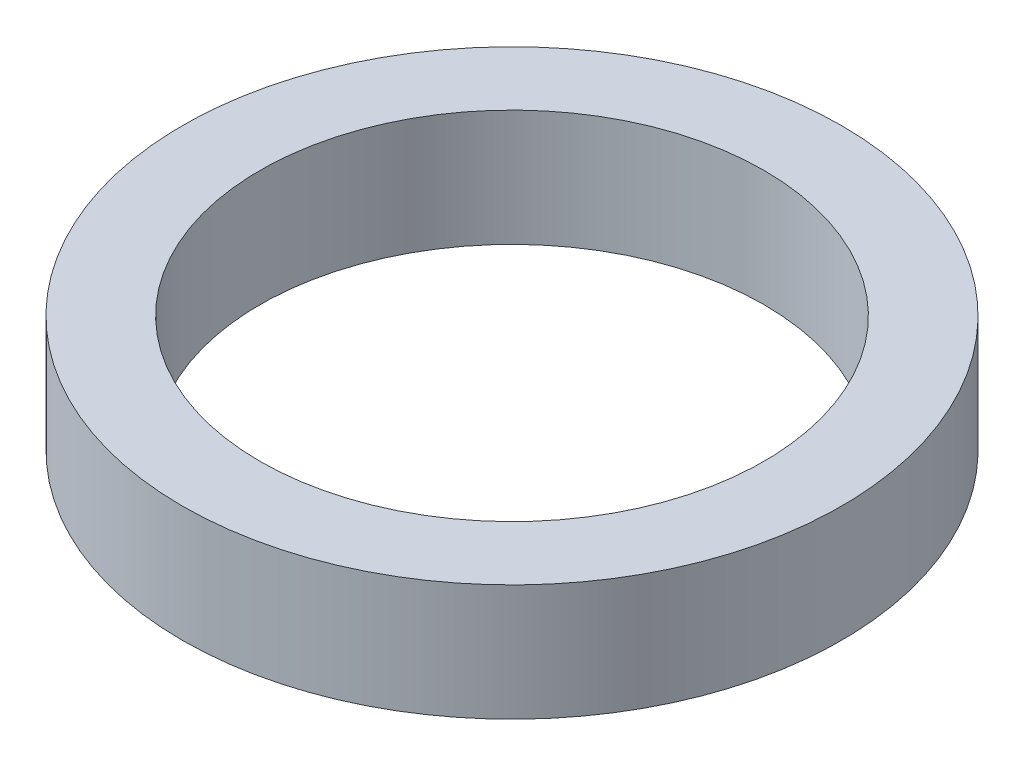
ISO-10303-21;
HEADER;
FILE_DESCRIPTION(('STEP AP214'),'2;1');
FILE_NAME('part.step','',(''),(''),'','','');
FILE_SCHEMA(('AUTOMOTIVE_DESIGN { 1 0 10303 214 1 1 1 1 }'));
ENDSEC;
DATA;
#1=APPLICATION_CONTEXT('core data for automotive mechanical design processes');
#2=APPLICATION_PROTOCOL_DEFINITION('international standard','automotive_design',2000,#1);
#3=PRODUCT_CONTEXT('',#1,'mechanical');
#4=PRODUCT('Part','Part','',(#3));
#5=PRODUCT_RELATED_PRODUCT_CATEGORY('part','',(#4));
#6=PRODUCT_DEFINITION_FORMATION('','',#4);
#7=PRODUCT_DEFINITION_CONTEXT('part definition',#1,'design');
#8=PRODUCT_DEFINITION('design','',#6,#7);
#9=PRODUCT_DEFINITION_SHAPE('','',#8);
#10=(LENGTH_UNIT() NAMED_UNIT(*) SI_UNIT(.MILLI.,.METRE.));
#11=(NAMED_UNIT(*) PLANE_ANGLE_UNIT() SI_UNIT($,.RADIAN.));
#12=(NAMED_UNIT(*) SI_UNIT($,.STERADIAN.) SOLID_ANGLE_UNIT());
#13=UNCERTAINTY_MEASURE_WITH_UNIT(LENGTH_MEASURE(1.E-05),#10,'distance_accuracy_value','');
#14=(GEOMETRIC_REPRESENTATION_CONTEXT(3) GLOBAL_UNCERTAINTY_ASSIGNED_CONTEXT((#13)) GLOBAL_UNIT_ASSIGNED_CONTEXT((#10,
#11,#12)) REPRESENTATION_CONTEXT('',''));
#15=CARTESIAN_POINT('',(0.,0.,0.));
#16=DIRECTION('',(0.,0.,1.));
#17=DIRECTION('',(1.,0.,0.));
#18=AXIS2_PLACEMENT_3D('',#15,#16,#17);
#19=CARTESIAN_POINT('',(0.,15.,0.));
#20=DIRECTION('',(0.,-1.,0.));
#21=DIRECTION('',(0.,0.,-1.));
#22=AXIS2_PLACEMENT_3D('',#19,#20,#21);
#23=CYLINDRICAL_SURFACE('',#22,42.5);
#24=CARTESIAN_POINT('',(0.,15.,0.));
#25=DIRECTION('',(0.,1.,0.));
#26=DIRECTION('',(0.,0.,1.));
#27=AXIS2_PLACEMENT_3D('',#24,#25,#26);
#28=CIRCLE('',#27,42.5);
#29=CARTESIAN_POINT('',(0.,15.,42.5));
#30=VERTEX_POINT('',#29);
#31=EDGE_CURVE('E10',#30,#30,#28,.T.);
#32=ORIENTED_EDGE('',*,*,#31,.F.);
#33=EDGE_LOOP('',(#32));
#34=FACE_BOUND('',#33,.T.);
#35=CARTESIAN_POINT('',(0.,0.,0.));
#36=DIRECTION('',(0.,1.,0.));
#37=DIRECTION('',(0.,0.,1.));
#38=AXIS2_PLACEMENT_3D('',#35,#36,#37);
#39=CIRCLE('',#38,42.5);
#40=CARTESIAN_POINT('',(0.,0.,42.5));
#41=VERTEX_POINT('',#40);
#42=EDGE_CURVE('E37',#41,#41,#39,.T.);
#43=ORIENTED_EDGE('',*,*,#42,.T.);
#44=EDGE_LOOP('',(#43));
#45=FACE_BOUND('',#44,.T.);
#46=ADVANCED_FACE('F40',(#34,#45),#23,.T.);
#47=CARTESIAN_POINT('',(0.,15.,0.));
#48=DIRECTION('',(0.,1.,0.));
#49=DIRECTION('',(0.,0.,1.));
#50=AXIS2_PLACEMENT_3D('',#47,#48,#49);
#51=PLANE('',#50);
#52=CARTESIAN_POINT('',(0.,15.,0.));
#53=DIRECTION('',(0.,1.,0.));
#54=DIRECTION('',(0.,0.,1.));
#55=AXIS2_PLACEMENT_3D('',#52,#53,#54);
#56=CIRCLE('',#55,32.5);
#57=CARTESIAN_POINT('',(0.,15.,32.5));
#58=VERTEX_POINT('',#57);
#59=EDGE_CURVE('E50',#58,#58,#56,.T.);
#60=ORIENTED_EDGE('',*,*,#59,.F.);
#61=EDGE_LOOP('',(#60));
#62=FACE_BOUND('',#61,.T.);
#63=ORIENTED_EDGE('',*,*,#31,.T.);
#64=EDGE_LOOP('',(#63));
#65=FACE_BOUND('',#64,.T.);
#66=ADVANCED_FACE('F59',(#62,#65),#51,.T.);
#67=CARTESIAN_POINT('',(0.,0.,0.));
#68=DIRECTION('',(0.,1.,0.));
#69=DIRECTION('',(0.,0.,1.));
#70=AXIS2_PLACEMENT_3D('',#67,#68,#69);
#71=PLANE('',#70);
#72=CARTESIAN_POINT('',(0.,0.,0.));
#73=DIRECTION('',(0.,1.,0.));
#74=DIRECTION('',(0.,0.,1.));
#75=AXIS2_PLACEMENT_3D('',#72,#73,#74);
#76=CIRCLE('',#75,32.5);
#77=CARTESIAN_POINT('',(0.,0.,32.5));
#78=VERTEX_POINT('',#77);
#79=EDGE_CURVE('E47',#78,#78,#76,.T.);
#80=ORIENTED_EDGE('',*,*,#79,.T.);
#81=EDGE_LOOP('',(#80));
#82=FACE_BOUND('',#81,.T.);
#83=ORIENTED_EDGE('',*,*,#42,.F.);
#84=EDGE_LOOP('',(#83));
#85=FACE_BOUND('',#84,.T.);
#86=ADVANCED_FACE('F58',(#82,#85),#71,.F.);
#87=CARTESIAN_POINT('',(0.,15.,0.));
#88=DIRECTION('',(0.,-1.,0.));
#89=DIRECTION('',(0.,0.,-1.));
#90=AXIS2_PLACEMENT_3D('',#87,#88,#89);
#91=CYLINDRICAL_SURFACE('',#90,32.5);
#92=ORIENTED_EDGE('',*,*,#59,.T.);
#93=EDGE_LOOP('',(#92));
#94=FACE_BOUND('',#93,.T.);
#95=ORIENTED_EDGE('',*,*,#79,.F.);
#96=EDGE_LOOP('',(#95));
#97=FACE_BOUND('',#96,.T.);
#98=ADVANCED_FACE('F54',(#94,#97),#91,.F.);
#99=CLOSED_SHELL('',(#46,#66,#86,#98));
#100=MANIFOLD_SOLID_BREP('B2',#99);
#101=ADVANCED_BREP_SHAPE_REPRESENTATION('',(#18,#100),#14);
#102=SHAPE_DEFINITION_REPRESENTATION(#9,#101);
ENDSEC;
END-ISO-10303-21;
